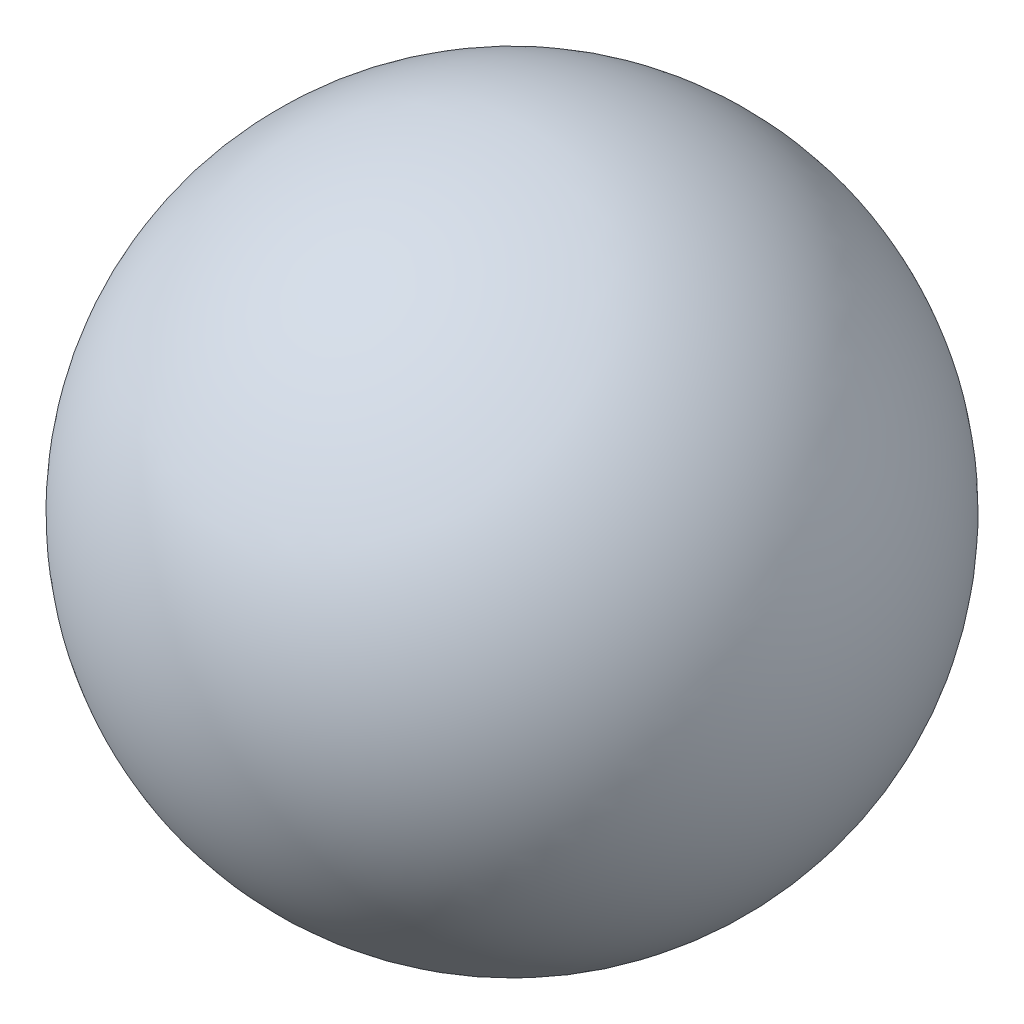
ISO-10303-21;
HEADER;
FILE_DESCRIPTION(('STEP AP214'),'2;1');
FILE_NAME('part.step','',(''),(''),'','','');
FILE_SCHEMA(('AUTOMOTIVE_DESIGN { 1 0 10303 214 1 1 1 1 }'));
ENDSEC;
DATA;
#1=APPLICATION_CONTEXT('core data for automotive mechanical design processes');
#2=APPLICATION_PROTOCOL_DEFINITION('international standard','automotive_design',2000,#1);
#3=PRODUCT_CONTEXT('',#1,'mechanical');
#4=PRODUCT('Part','Part','',(#3));
#5=PRODUCT_RELATED_PRODUCT_CATEGORY('part','',(#4));
#6=PRODUCT_DEFINITION_FORMATION('','',#4);
#7=PRODUCT_DEFINITION_CONTEXT('part definition',#1,'design');
#8=PRODUCT_DEFINITION('design','',#6,#7);
#9=PRODUCT_DEFINITION_SHAPE('','',#8);
#10=(LENGTH_UNIT() NAMED_UNIT(*) SI_UNIT(.MILLI.,.METRE.));
#11=(NAMED_UNIT(*) PLANE_ANGLE_UNIT() SI_UNIT($,.RADIAN.));
#12=(NAMED_UNIT(*) SI_UNIT($,.STERADIAN.) SOLID_ANGLE_UNIT());
#13=UNCERTAINTY_MEASURE_WITH_UNIT(LENGTH_MEASURE(1.E-05),#10,'distance_accuracy_value','');
#14=(GEOMETRIC_REPRESENTATION_CONTEXT(3) GLOBAL_UNCERTAINTY_ASSIGNED_CONTEXT((#13)) GLOBAL_UNIT_ASSIGNED_CONTEXT((#10,
#11,#12)) REPRESENTATION_CONTEXT('',''));
#15=CARTESIAN_POINT('',(0.,0.,0.));
#16=DIRECTION('',(0.,0.,1.));
#17=DIRECTION('',(1.,0.,0.));
#18=AXIS2_PLACEMENT_3D('',#15,#16,#17);
#19=CARTESIAN_POINT('',(-11.630401942101,-2.,-1.6721993497111));
#20=DIRECTION('',(0.,0.,1.));
#21=DIRECTION('',(1.,0.,0.));
#22=AXIS2_PLACEMENT_3D('',#19,#20,#21);
#23=SPHERICAL_SURFACE('',#22,1.05);
#24=CARTESIAN_POINT('',(-11.630401942101,-2.,-0.6221993497111));
#25=VERTEX_POINT('',#24);
#26=VERTEX_LOOP('',#25);
#27=FACE_BOUND('',#26,.T.);
#28=ADVANCED_FACE('F12',(#27),#23,.T.);
#29=CLOSED_SHELL('',(#28));
#30=MANIFOLD_SOLID_BREP('B1',#29);
#31=ADVANCED_BREP_SHAPE_REPRESENTATION('',(#18,#30),#14);
#32=SHAPE_DEFINITION_REPRESENTATION(#9,#31);
ENDSEC;
END-ISO-10303-21;
